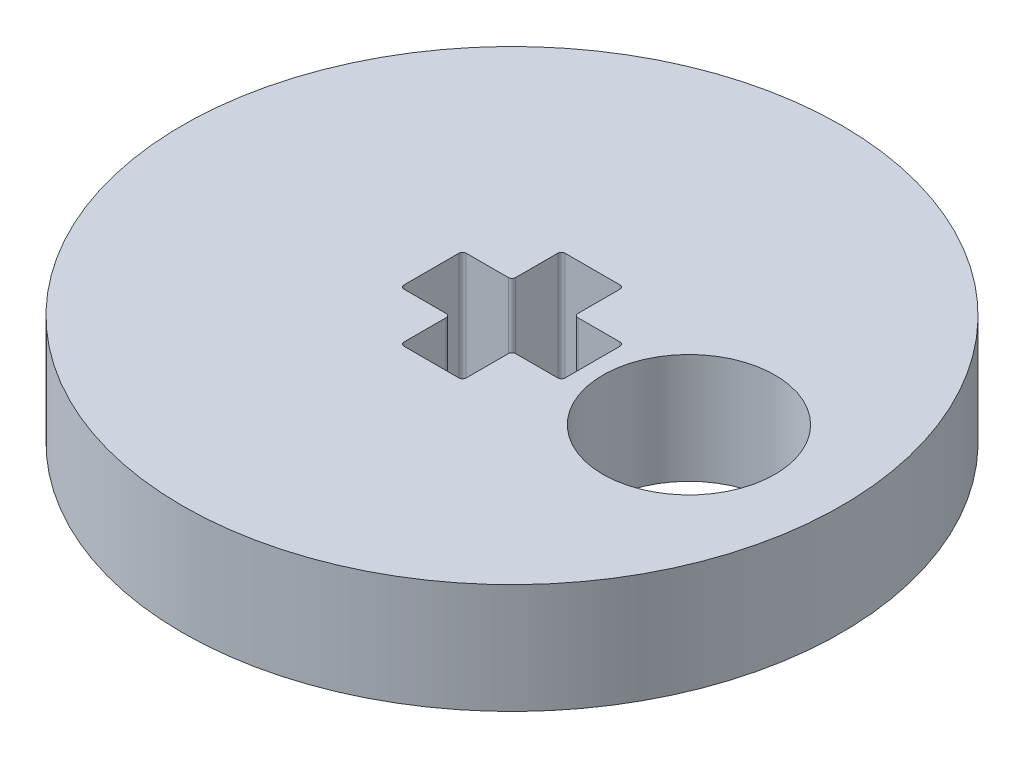
ISO-10303-21;
HEADER;
FILE_DESCRIPTION(('STEP AP214'),'2;1');
FILE_NAME('part.step','',(''),(''),'','','');
FILE_SCHEMA(('AUTOMOTIVE_DESIGN { 1 0 10303 214 1 1 1 1 }'));
ENDSEC;
DATA;
#1=APPLICATION_CONTEXT('core data for automotive mechanical design processes');
#2=APPLICATION_PROTOCOL_DEFINITION('international standard','automotive_design',2000,#1);
#3=PRODUCT_CONTEXT('',#1,'mechanical');
#4=PRODUCT('Part','Part','',(#3));
#5=PRODUCT_RELATED_PRODUCT_CATEGORY('part','',(#4));
#6=PRODUCT_DEFINITION_FORMATION('','',#4);
#7=PRODUCT_DEFINITION_CONTEXT('part definition',#1,'design');
#8=PRODUCT_DEFINITION('design','',#6,#7);
#9=PRODUCT_DEFINITION_SHAPE('','',#8);
#10=(LENGTH_UNIT() NAMED_UNIT(*) SI_UNIT(.MILLI.,.METRE.));
#11=(NAMED_UNIT(*) PLANE_ANGLE_UNIT() SI_UNIT($,.RADIAN.));
#12=(NAMED_UNIT(*) SI_UNIT($,.STERADIAN.) SOLID_ANGLE_UNIT());
#13=UNCERTAINTY_MEASURE_WITH_UNIT(LENGTH_MEASURE(1.E-05),#10,'distance_accuracy_value','');
#14=(GEOMETRIC_REPRESENTATION_CONTEXT(3) GLOBAL_UNCERTAINTY_ASSIGNED_CONTEXT((#13)) GLOBAL_UNIT_ASSIGNED_CONTEXT((#10,
#11,#12)) REPRESENTATION_CONTEXT('',''));
#15=CARTESIAN_POINT('',(0.,0.,0.));
#16=DIRECTION('',(0.,0.,1.));
#17=DIRECTION('',(1.,0.,0.));
#18=AXIS2_PLACEMENT_3D('',#15,#16,#17);
#19=CARTESIAN_POINT('',(0.,3.,0.));
#20=DIRECTION('',(0.,1.,0.));
#21=DIRECTION('',(0.,0.,1.));
#22=AXIS2_PLACEMENT_3D('',#19,#20,#21);
#23=PLANE('',#22);
#24=DIRECTION('',(1.,0.,0.));
#25=VECTOR('',#24,1.);
#26=CARTESIAN_POINT('',(0.850000000000001,3.,0.850000000000001));
#27=LINE('',#26,#25);
#28=CARTESIAN_POINT('',(0.950000000000001,3.,0.850000000000001));
#29=VERTEX_POINT('',#28);
#30=CARTESIAN_POINT('',(2.1,3.,0.850000000000001));
#31=VERTEX_POINT('',#30);
#32=EDGE_CURVE('E376',#29,#31,#27,.T.);
#33=ORIENTED_EDGE('',*,*,#32,.F.);
#34=CARTESIAN_POINT('',(0.950000000000001,3.,0.950000000000001));
#35=DIRECTION('',(0.,1.,0.));
#36=DIRECTION('',(0.,0.,1.));
#37=AXIS2_PLACEMENT_3D('',#34,#35,#36);
#38=CIRCLE('',#37,0.1);
#39=CARTESIAN_POINT('',(0.850000000000001,3.,0.950000000000001));
#40=VERTEX_POINT('',#39);
#41=EDGE_CURVE('E230',#29,#40,#38,.T.);
#42=ORIENTED_EDGE('',*,*,#41,.T.);
#43=DIRECTION('',(0.,0.,-1.));
#44=VECTOR('',#43,1.);
#45=CARTESIAN_POINT('',(0.850000000000001,3.,2.2));
#46=LINE('',#45,#44);
#47=CARTESIAN_POINT('',(0.850000000000001,3.,2.1));
#48=VERTEX_POINT('',#47);
#49=EDGE_CURVE('E373',#48,#40,#46,.T.);
#50=ORIENTED_EDGE('',*,*,#49,.F.);
#51=CARTESIAN_POINT('',(0.75,3.,2.1));
#52=DIRECTION('',(0.,1.,0.));
#53=DIRECTION('',(0.,0.,1.));
#54=AXIS2_PLACEMENT_3D('',#51,#52,#53);
#55=CIRCLE('',#54,0.1);
#56=CARTESIAN_POINT('',(0.75,3.,2.2));
#57=VERTEX_POINT('',#56);
#58=EDGE_CURVE('E308',#48,#57,#55,.F.);
#59=ORIENTED_EDGE('',*,*,#58,.T.);
#60=DIRECTION('',(1.,0.,0.));
#61=VECTOR('',#60,1.);
#62=CARTESIAN_POINT('',(-0.849999999999999,3.,2.2));
#63=LINE('',#62,#61);
#64=CARTESIAN_POINT('',(-0.749999999999999,3.,2.2));
#65=VERTEX_POINT('',#64);
#66=EDGE_CURVE('E370',#65,#57,#63,.T.);
#67=ORIENTED_EDGE('',*,*,#66,.F.);
#68=CARTESIAN_POINT('',(-0.749999999999999,3.,2.1));
#69=DIRECTION('',(0.,1.,0.));
#70=DIRECTION('',(0.,0.,1.));
#71=AXIS2_PLACEMENT_3D('',#68,#69,#70);
#72=CIRCLE('',#71,0.1);
#73=CARTESIAN_POINT('',(-0.849999999999999,3.,2.1));
#74=VERTEX_POINT('',#73);
#75=EDGE_CURVE('E312',#65,#74,#72,.F.);
#76=ORIENTED_EDGE('',*,*,#75,.T.);
#77=DIRECTION('',(0.,0.,1.));
#78=VECTOR('',#77,1.);
#79=CARTESIAN_POINT('',(-0.849999999999999,3.,0.850000000000001));
#80=LINE('',#79,#78);
#81=CARTESIAN_POINT('',(-0.849999999999999,3.,0.950000000000001));
#82=VERTEX_POINT('',#81);
#83=EDGE_CURVE('E367',#82,#74,#80,.T.);
#84=ORIENTED_EDGE('',*,*,#83,.F.);
#85=CARTESIAN_POINT('',(-0.949999999999999,3.,0.950000000000001));
#86=DIRECTION('',(0.,1.,0.));
#87=DIRECTION('',(0.,0.,1.));
#88=AXIS2_PLACEMENT_3D('',#85,#86,#87);
#89=CIRCLE('',#88,0.1);
#90=CARTESIAN_POINT('',(-0.95,3.,0.850000000000001));
#91=VERTEX_POINT('',#90);
#92=EDGE_CURVE('E57',#82,#91,#89,.T.);
#93=ORIENTED_EDGE('',*,*,#92,.T.);
#94=DIRECTION('',(1.,0.,0.));
#95=VECTOR('',#94,1.);
#96=CARTESIAN_POINT('',(-2.2,3.,0.850000000000001));
#97=LINE('',#96,#95);
#98=CARTESIAN_POINT('',(-2.1,3.,0.850000000000001));
#99=VERTEX_POINT('',#98);
#100=EDGE_CURVE('E357',#99,#91,#97,.T.);
#101=ORIENTED_EDGE('',*,*,#100,.F.);
#102=CARTESIAN_POINT('',(-2.1,3.,0.750000000000001));
#103=DIRECTION('',(0.,1.,0.));
#104=DIRECTION('',(0.,0.,1.));
#105=AXIS2_PLACEMENT_3D('',#102,#103,#104);
#106=CIRCLE('',#105,0.1);
#107=CARTESIAN_POINT('',(-2.2,3.,0.750000000000001));
#108=VERTEX_POINT('',#107);
#109=EDGE_CURVE('E316',#99,#108,#106,.F.);
#110=ORIENTED_EDGE('',*,*,#109,.T.);
#111=DIRECTION('',(0.,0.,1.));
#112=VECTOR('',#111,1.);
#113=CARTESIAN_POINT('',(-2.2,3.,-0.849999999999999));
#114=LINE('',#113,#112);
#115=CARTESIAN_POINT('',(-2.2,3.,-0.749999999999999));
#116=VERTEX_POINT('',#115);
#117=EDGE_CURVE('E351',#116,#108,#114,.T.);
#118=ORIENTED_EDGE('',*,*,#117,.F.);
#119=CARTESIAN_POINT('',(-2.1,3.,-0.749999999999999));
#120=DIRECTION('',(0.,1.,0.));
#121=DIRECTION('',(0.,0.,1.));
#122=AXIS2_PLACEMENT_3D('',#119,#120,#121);
#123=CIRCLE('',#122,0.1);
#124=CARTESIAN_POINT('',(-2.1,3.,-0.849999999999999));
#125=VERTEX_POINT('',#124);
#126=EDGE_CURVE('E11',#116,#125,#123,.F.);
#127=ORIENTED_EDGE('',*,*,#126,.T.);
#128=DIRECTION('',(-1.,0.,0.));
#129=VECTOR('',#128,1.);
#130=CARTESIAN_POINT('',(-0.849999999999999,3.,-0.849999999999999));
#131=LINE('',#130,#129);
#132=CARTESIAN_POINT('',(-0.949999999999999,3.,-0.849999999999999));
#133=VERTEX_POINT('',#132);
#134=EDGE_CURVE('E349',#133,#125,#131,.T.);
#135=ORIENTED_EDGE('',*,*,#134,.F.);
#136=CARTESIAN_POINT('',(-0.949999999999999,3.,-0.95));
#137=DIRECTION('',(0.,1.,0.));
#138=DIRECTION('',(0.,0.,1.));
#139=AXIS2_PLACEMENT_3D('',#136,#137,#138);
#140=CIRCLE('',#139,0.1);
#141=CARTESIAN_POINT('',(-0.849999999999999,3.,-0.95));
#142=VERTEX_POINT('',#141);
#143=EDGE_CURVE('E215',#133,#142,#140,.T.);
#144=ORIENTED_EDGE('',*,*,#143,.T.);
#145=DIRECTION('',(0.,0.,1.));
#146=VECTOR('',#145,1.);
#147=CARTESIAN_POINT('',(-0.849999999999999,3.,-2.2));
#148=LINE('',#147,#146);
#149=CARTESIAN_POINT('',(-0.849999999999999,3.,-2.1));
#150=VERTEX_POINT('',#149);
#151=EDGE_CURVE('E390',#150,#142,#148,.T.);
#152=ORIENTED_EDGE('',*,*,#151,.F.);
#153=CARTESIAN_POINT('',(-0.749999999999999,3.,-2.1));
#154=DIRECTION('',(0.,1.,0.));
#155=DIRECTION('',(0.,0.,1.));
#156=AXIS2_PLACEMENT_3D('',#153,#154,#155);
#157=CIRCLE('',#156,0.1);
#158=CARTESIAN_POINT('',(-0.749999999999999,3.,-2.2));
#159=VERTEX_POINT('',#158);
#160=EDGE_CURVE('E328',#150,#159,#157,.F.);
#161=ORIENTED_EDGE('',*,*,#160,.T.);
#162=DIRECTION('',(-1.,0.,0.));
#163=VECTOR('',#162,1.);
#164=CARTESIAN_POINT('',(0.850000000000001,3.,-2.2));
#165=LINE('',#164,#163);
#166=CARTESIAN_POINT('',(0.750000000000001,3.,-2.2));
#167=VERTEX_POINT('',#166);
#168=EDGE_CURVE('E387',#167,#159,#165,.T.);
#169=ORIENTED_EDGE('',*,*,#168,.F.);
#170=CARTESIAN_POINT('',(0.750000000000001,3.,-2.1));
#171=DIRECTION('',(0.,1.,0.));
#172=DIRECTION('',(0.,0.,1.));
#173=AXIS2_PLACEMENT_3D('',#170,#171,#172);
#174=CIRCLE('',#173,0.1);
#175=CARTESIAN_POINT('',(0.850000000000001,3.,-2.1));
#176=VERTEX_POINT('',#175);
#177=EDGE_CURVE('E324',#167,#176,#174,.F.);
#178=ORIENTED_EDGE('',*,*,#177,.T.);
#179=DIRECTION('',(0.,0.,-1.));
#180=VECTOR('',#179,1.);
#181=CARTESIAN_POINT('',(0.850000000000001,3.,-0.85));
#182=LINE('',#181,#180);
#183=CARTESIAN_POINT('',(0.850000000000001,3.,-0.95));
#184=VERTEX_POINT('',#183);
#185=EDGE_CURVE('E384',#184,#176,#182,.T.);
#186=ORIENTED_EDGE('',*,*,#185,.F.);
#187=CARTESIAN_POINT('',(0.950000000000001,3.,-0.95));
#188=DIRECTION('',(0.,1.,0.));
#189=DIRECTION('',(0.,0.,1.));
#190=AXIS2_PLACEMENT_3D('',#187,#188,#189);
#191=CIRCLE('',#190,0.1);
#192=CARTESIAN_POINT('',(0.950000000000001,3.,-0.85));
#193=VERTEX_POINT('',#192);
#194=EDGE_CURVE('E254',#184,#193,#191,.T.);
#195=ORIENTED_EDGE('',*,*,#194,.T.);
#196=DIRECTION('',(-1.,0.,0.));
#197=VECTOR('',#196,1.);
#198=CARTESIAN_POINT('',(2.2,3.,-0.85));
#199=LINE('',#198,#197);
#200=CARTESIAN_POINT('',(2.1,3.,-0.85));
#201=VERTEX_POINT('',#200);
#202=EDGE_CURVE('E381',#201,#193,#199,.T.);
#203=ORIENTED_EDGE('',*,*,#202,.F.);
#204=CARTESIAN_POINT('',(2.1,3.,-0.75));
#205=DIRECTION('',(0.,1.,0.));
#206=DIRECTION('',(0.,0.,1.));
#207=AXIS2_PLACEMENT_3D('',#204,#205,#206);
#208=CIRCLE('',#207,0.1);
#209=CARTESIAN_POINT('',(2.2,3.,-0.75));
#210=VERTEX_POINT('',#209);
#211=EDGE_CURVE('E320',#201,#210,#208,.F.);
#212=ORIENTED_EDGE('',*,*,#211,.T.);
#213=DIRECTION('',(0.,0.,-1.));
#214=VECTOR('',#213,1.);
#215=CARTESIAN_POINT('',(2.2,3.,0.850000000000001));
#216=LINE('',#215,#214);
#217=CARTESIAN_POINT('',(2.2,3.,0.750000000000001));
#218=VERTEX_POINT('',#217);
#219=EDGE_CURVE('E378',#218,#210,#216,.T.);
#220=ORIENTED_EDGE('',*,*,#219,.F.);
#221=CARTESIAN_POINT('',(2.1,3.,0.750000000000001));
#222=DIRECTION('',(0.,1.,0.));
#223=DIRECTION('',(0.,0.,1.));
#224=AXIS2_PLACEMENT_3D('',#221,#222,#223);
#225=CIRCLE('',#224,0.1);
#226=EDGE_CURVE('E304',#218,#31,#225,.F.);
#227=ORIENTED_EDGE('',*,*,#226,.T.);
#228=EDGE_LOOP('',(#33,#42,#50,#59,#67,#76,#84,#93,#101,#110,#118,#127,#135,#144,#152,#161,#169,
#178,#186,#195,#203,#212,#220,#227));
#229=FACE_BOUND('',#228,.T.);
#230=CARTESIAN_POINT('',(0.,3.,0.));
#231=DIRECTION('',(0.,1.,0.));
#232=DIRECTION('',(0.,0.,1.));
#233=AXIS2_PLACEMENT_3D('',#230,#231,#232);
#234=CIRCLE('',#233,9.);
#235=CARTESIAN_POINT('',(0.,3.,9.));
#236=VERTEX_POINT('',#235);
#237=EDGE_CURVE('E231',#236,#236,#234,.T.);
#238=ORIENTED_EDGE('',*,*,#237,.T.);
#239=EDGE_LOOP('',(#238));
#240=FACE_BOUND('',#239,.T.);
#241=CARTESIAN_POINT('',(4.99728198946741,3.,0.16484149278824));
#242=DIRECTION('',(0.,1.,0.));
#243=DIRECTION('',(0.,0.,1.));
#244=AXIS2_PLACEMENT_3D('',#241,#242,#243);
#245=CIRCLE('',#244,2.35);
#246=CARTESIAN_POINT('',(4.99728198946741,3.,2.51484149278824));
#247=VERTEX_POINT('',#246);
#248=EDGE_CURVE('E393',#247,#247,#245,.T.);
#249=ORIENTED_EDGE('',*,*,#248,.F.);
#250=EDGE_LOOP('',(#249));
#251=FACE_BOUND('',#250,.T.);
#252=ADVANCED_FACE('F42',(#229,#240,#251),#23,.T.);
#253=CARTESIAN_POINT('',(0.,0.,0.));
#254=DIRECTION('',(0.,1.,0.));
#255=DIRECTION('',(0.,0.,1.));
#256=AXIS2_PLACEMENT_3D('',#253,#254,#255);
#257=PLANE('',#256);
#258=CARTESIAN_POINT('',(0.,0.,0.));
#259=DIRECTION('',(0.,1.,0.));
#260=DIRECTION('',(0.,0.,1.));
#261=AXIS2_PLACEMENT_3D('',#258,#259,#260);
#262=CIRCLE('',#261,9.);
#263=CARTESIAN_POINT('',(0.,0.,9.));
#264=VERTEX_POINT('',#263);
#265=EDGE_CURVE('E236',#264,#264,#262,.T.);
#266=ORIENTED_EDGE('',*,*,#265,.F.);
#267=EDGE_LOOP('',(#266));
#268=FACE_BOUND('',#267,.T.);
#269=DIRECTION('',(0.,0.,-1.));
#270=VECTOR('',#269,1.);
#271=CARTESIAN_POINT('',(0.850000000000001,0.,2.2));
#272=LINE('',#271,#270);
#273=CARTESIAN_POINT('',(0.850000000000001,0.,2.1));
#274=VERTEX_POINT('',#273);
#275=CARTESIAN_POINT('',(0.850000000000001,0.,0.950000000000001));
#276=VERTEX_POINT('',#275);
#277=EDGE_CURVE('E210',#274,#276,#272,.T.);
#278=ORIENTED_EDGE('',*,*,#277,.T.);
#279=CARTESIAN_POINT('',(0.950000000000001,0.,0.950000000000001));
#280=DIRECTION('',(0.,1.,0.));
#281=DIRECTION('',(0.,0.,1.));
#282=AXIS2_PLACEMENT_3D('',#279,#280,#281);
#283=CIRCLE('',#282,0.1);
#284=CARTESIAN_POINT('',(0.950000000000001,0.,0.850000000000001));
#285=VERTEX_POINT('',#284);
#286=EDGE_CURVE('E204',#276,#285,#283,.F.);
#287=ORIENTED_EDGE('',*,*,#286,.T.);
#288=DIRECTION('',(1.,0.,0.));
#289=VECTOR('',#288,1.);
#290=CARTESIAN_POINT('',(0.850000000000001,0.,0.850000000000001));
#291=LINE('',#290,#289);
#292=CARTESIAN_POINT('',(2.1,0.,0.850000000000001));
#293=VERTEX_POINT('',#292);
#294=EDGE_CURVE('E208',#285,#293,#291,.T.);
#295=ORIENTED_EDGE('',*,*,#294,.T.);
#296=CARTESIAN_POINT('',(2.1,0.,0.750000000000001));
#297=DIRECTION('',(0.,1.,0.));
#298=DIRECTION('',(0.,0.,1.));
#299=AXIS2_PLACEMENT_3D('',#296,#297,#298);
#300=CIRCLE('',#299,0.1);
#301=CARTESIAN_POINT('',(2.2,0.,0.750000000000001));
#302=VERTEX_POINT('',#301);
#303=EDGE_CURVE('E302',#293,#302,#300,.T.);
#304=ORIENTED_EDGE('',*,*,#303,.T.);
#305=DIRECTION('',(0.,0.,-1.));
#306=VECTOR('',#305,1.);
#307=CARTESIAN_POINT('',(2.2,0.,0.850000000000001));
#308=LINE('',#307,#306);
#309=CARTESIAN_POINT('',(2.2,0.,-0.75));
#310=VERTEX_POINT('',#309);
#311=EDGE_CURVE('E226',#302,#310,#308,.T.);
#312=ORIENTED_EDGE('',*,*,#311,.T.);
#313=CARTESIAN_POINT('',(2.1,0.,-0.75));
#314=DIRECTION('',(0.,1.,0.));
#315=DIRECTION('',(0.,0.,1.));
#316=AXIS2_PLACEMENT_3D('',#313,#314,#315);
#317=CIRCLE('',#316,0.1);
#318=CARTESIAN_POINT('',(2.1,0.,-0.85));
#319=VERTEX_POINT('',#318);
#320=EDGE_CURVE('E318',#310,#319,#317,.T.);
#321=ORIENTED_EDGE('',*,*,#320,.T.);
#322=DIRECTION('',(-1.,0.,0.));
#323=VECTOR('',#322,1.);
#324=CARTESIAN_POINT('',(2.2,0.,-0.85));
#325=LINE('',#324,#323);
#326=CARTESIAN_POINT('',(0.950000000000001,0.,-0.85));
#327=VERTEX_POINT('',#326);
#328=EDGE_CURVE('E406',#319,#327,#325,.T.);
#329=ORIENTED_EDGE('',*,*,#328,.T.);
#330=CARTESIAN_POINT('',(0.950000000000001,0.,-0.95));
#331=DIRECTION('',(0.,1.,0.));
#332=DIRECTION('',(0.,0.,1.));
#333=AXIS2_PLACEMENT_3D('',#330,#331,#332);
#334=CIRCLE('',#333,0.1);
#335=CARTESIAN_POINT('',(0.850000000000001,0.,-0.95));
#336=VERTEX_POINT('',#335);
#337=EDGE_CURVE('E250',#327,#336,#334,.F.);
#338=ORIENTED_EDGE('',*,*,#337,.T.);
#339=DIRECTION('',(0.,0.,-1.));
#340=VECTOR('',#339,1.);
#341=CARTESIAN_POINT('',(0.850000000000001,0.,-0.85));
#342=LINE('',#341,#340);
#343=CARTESIAN_POINT('',(0.850000000000001,0.,-2.1));
#344=VERTEX_POINT('',#343);
#345=EDGE_CURVE('E409',#336,#344,#342,.T.);
#346=ORIENTED_EDGE('',*,*,#345,.T.);
#347=CARTESIAN_POINT('',(0.750000000000001,0.,-2.1));
#348=DIRECTION('',(0.,1.,0.));
#349=DIRECTION('',(0.,0.,1.));
#350=AXIS2_PLACEMENT_3D('',#347,#348,#349);
#351=CIRCLE('',#350,0.1);
#352=CARTESIAN_POINT('',(0.750000000000001,0.,-2.2));
#353=VERTEX_POINT('',#352);
#354=EDGE_CURVE('E322',#344,#353,#351,.T.);
#355=ORIENTED_EDGE('',*,*,#354,.T.);
#356=DIRECTION('',(-1.,0.,0.));
#357=VECTOR('',#356,1.);
#358=CARTESIAN_POINT('',(0.850000000000001,0.,-2.2));
#359=LINE('',#358,#357);
#360=CARTESIAN_POINT('',(-0.749999999999999,0.,-2.2));
#361=VERTEX_POINT('',#360);
#362=EDGE_CURVE('E360',#353,#361,#359,.T.);
#363=ORIENTED_EDGE('',*,*,#362,.T.);
#364=CARTESIAN_POINT('',(-0.749999999999999,0.,-2.1));
#365=DIRECTION('',(0.,1.,0.));
#366=DIRECTION('',(0.,0.,1.));
#367=AXIS2_PLACEMENT_3D('',#364,#365,#366);
#368=CIRCLE('',#367,0.1);
#369=CARTESIAN_POINT('',(-0.849999999999999,0.,-2.1));
#370=VERTEX_POINT('',#369);
#371=EDGE_CURVE('E326',#361,#370,#368,.T.);
#372=ORIENTED_EDGE('',*,*,#371,.T.);
#373=DIRECTION('',(0.,0.,1.));
#374=VECTOR('',#373,1.);
#375=CARTESIAN_POINT('',(-0.849999999999999,0.,-2.2));
#376=LINE('',#375,#374);
#377=CARTESIAN_POINT('',(-0.849999999999999,0.,-0.95));
#378=VERTEX_POINT('',#377);
#379=EDGE_CURVE('E355',#370,#378,#376,.T.);
#380=ORIENTED_EDGE('',*,*,#379,.T.);
#381=CARTESIAN_POINT('',(-0.949999999999999,0.,-0.95));
#382=DIRECTION('',(0.,1.,0.));
#383=DIRECTION('',(0.,0.,1.));
#384=AXIS2_PLACEMENT_3D('',#381,#382,#383);
#385=CIRCLE('',#384,0.1);
#386=CARTESIAN_POINT('',(-0.949999999999999,0.,-0.849999999999999));
#387=VERTEX_POINT('',#386);
#388=EDGE_CURVE('E248',#378,#387,#385,.F.);
#389=ORIENTED_EDGE('',*,*,#388,.T.);
#390=DIRECTION('',(-1.,0.,0.));
#391=VECTOR('',#390,1.);
#392=CARTESIAN_POINT('',(-0.849999999999999,0.,-0.849999999999999));
#393=LINE('',#392,#391);
#394=CARTESIAN_POINT('',(-2.1,0.,-0.849999999999999));
#395=VERTEX_POINT('',#394);
#396=EDGE_CURVE('E334',#387,#395,#393,.T.);
#397=ORIENTED_EDGE('',*,*,#396,.T.);
#398=CARTESIAN_POINT('',(-2.1,0.,-0.749999999999999));
#399=DIRECTION('',(0.,1.,0.));
#400=DIRECTION('',(0.,0.,1.));
#401=AXIS2_PLACEMENT_3D('',#398,#399,#400);
#402=CIRCLE('',#401,0.1);
#403=CARTESIAN_POINT('',(-2.2,0.,-0.749999999999999));
#404=VERTEX_POINT('',#403);
#405=EDGE_CURVE('E50',#395,#404,#402,.T.);
#406=ORIENTED_EDGE('',*,*,#405,.T.);
#407=DIRECTION('',(0.,0.,1.));
#408=VECTOR('',#407,1.);
#409=CARTESIAN_POINT('',(-2.2,0.,-0.849999999999999));
#410=LINE('',#409,#408);
#411=CARTESIAN_POINT('',(-2.2,0.,0.750000000000001));
#412=VERTEX_POINT('',#411);
#413=EDGE_CURVE('E332',#404,#412,#410,.T.);
#414=ORIENTED_EDGE('',*,*,#413,.T.);
#415=CARTESIAN_POINT('',(-2.1,0.,0.750000000000001));
#416=DIRECTION('',(0.,1.,0.));
#417=DIRECTION('',(0.,0.,1.));
#418=AXIS2_PLACEMENT_3D('',#415,#416,#417);
#419=CIRCLE('',#418,0.1);
#420=CARTESIAN_POINT('',(-2.1,0.,0.850000000000001));
#421=VERTEX_POINT('',#420);
#422=EDGE_CURVE('E314',#412,#421,#419,.T.);
#423=ORIENTED_EDGE('',*,*,#422,.T.);
#424=DIRECTION('',(1.,0.,0.));
#425=VECTOR('',#424,1.);
#426=CARTESIAN_POINT('',(-2.2,0.,0.850000000000001));
#427=LINE('',#426,#425);
#428=CARTESIAN_POINT('',(-0.95,0.,0.850000000000001));
#429=VERTEX_POINT('',#428);
#430=EDGE_CURVE('E343',#421,#429,#427,.T.);
#431=ORIENTED_EDGE('',*,*,#430,.T.);
#432=CARTESIAN_POINT('',(-0.949999999999999,0.,0.950000000000001));
#433=DIRECTION('',(0.,1.,0.));
#434=DIRECTION('',(0.,0.,1.));
#435=AXIS2_PLACEMENT_3D('',#432,#433,#434);
#436=CIRCLE('',#435,0.1);
#437=CARTESIAN_POINT('',(-0.849999999999999,0.,0.950000000000001));
#438=VERTEX_POINT('',#437);
#439=EDGE_CURVE('E216',#429,#438,#436,.F.);
#440=ORIENTED_EDGE('',*,*,#439,.T.);
#441=DIRECTION('',(0.,0.,1.));
#442=VECTOR('',#441,1.);
#443=CARTESIAN_POINT('',(-0.849999999999999,0.,0.850000000000001));
#444=LINE('',#443,#442);
#445=CARTESIAN_POINT('',(-0.849999999999999,0.,2.1));
#446=VERTEX_POINT('',#445);
#447=EDGE_CURVE('E397',#438,#446,#444,.T.);
#448=ORIENTED_EDGE('',*,*,#447,.T.);
#449=CARTESIAN_POINT('',(-0.749999999999999,0.,2.1));
#450=DIRECTION('',(0.,1.,0.));
#451=DIRECTION('',(0.,0.,1.));
#452=AXIS2_PLACEMENT_3D('',#449,#450,#451);
#453=CIRCLE('',#452,0.1);
#454=CARTESIAN_POINT('',(-0.749999999999999,0.,2.2));
#455=VERTEX_POINT('',#454);
#456=EDGE_CURVE('E310',#446,#455,#453,.T.);
#457=ORIENTED_EDGE('',*,*,#456,.T.);
#458=DIRECTION('',(1.,0.,0.));
#459=VECTOR('',#458,1.);
#460=CARTESIAN_POINT('',(-0.849999999999999,0.,2.2));
#461=LINE('',#460,#459);
#462=CARTESIAN_POINT('',(0.75,0.,2.2));
#463=VERTEX_POINT('',#462);
#464=EDGE_CURVE('E400',#455,#463,#461,.T.);
#465=ORIENTED_EDGE('',*,*,#464,.T.);
#466=CARTESIAN_POINT('',(0.75,0.,2.1));
#467=DIRECTION('',(0.,1.,0.));
#468=DIRECTION('',(0.,0.,1.));
#469=AXIS2_PLACEMENT_3D('',#466,#467,#468);
#470=CIRCLE('',#469,0.1);
#471=EDGE_CURVE('E306',#463,#274,#470,.T.);
#472=ORIENTED_EDGE('',*,*,#471,.T.);
#473=EDGE_LOOP('',(#278,#287,#295,#304,#312,#321,#329,#338,#346,#355,#363,#372,#380,#389,#397,
#406,#414,#423,#431,#440,#448,#457,#465,#472));
#474=FACE_BOUND('',#473,.T.);
#475=CARTESIAN_POINT('',(4.99728198946741,0.,0.16484149278824));
#476=DIRECTION('',(0.,1.,0.));
#477=DIRECTION('',(0.,0.,1.));
#478=AXIS2_PLACEMENT_3D('',#475,#476,#477);
#479=CIRCLE('',#478,2.35);
#480=CARTESIAN_POINT('',(4.99728198946741,0.,2.51484149278824));
#481=VERTEX_POINT('',#480);
#482=EDGE_CURVE('E363',#481,#481,#479,.T.);
#483=ORIENTED_EDGE('',*,*,#482,.T.);
#484=EDGE_LOOP('',(#483));
#485=FACE_BOUND('',#484,.T.);
#486=ADVANCED_FACE('F206',(#268,#474,#485),#257,.F.);
#487=CARTESIAN_POINT('',(0.,3.,0.));
#488=DIRECTION('',(0.,-1.,0.));
#489=DIRECTION('',(0.,0.,-1.));
#490=AXIS2_PLACEMENT_3D('',#487,#488,#489);
#491=CYLINDRICAL_SURFACE('',#490,9.);
#492=ORIENTED_EDGE('',*,*,#237,.F.);
#493=EDGE_LOOP('',(#492));
#494=FACE_BOUND('',#493,.T.);
#495=ORIENTED_EDGE('',*,*,#265,.T.);
#496=EDGE_LOOP('',(#495));
#497=FACE_BOUND('',#496,.T.);
#498=ADVANCED_FACE('F492',(#494,#497),#491,.T.);
#499=CARTESIAN_POINT('',(-0.849999999999999,3.,-0.849999999999999));
#500=DIRECTION('',(0.,0.,1.));
#501=DIRECTION('',(1.,0.,0.));
#502=AXIS2_PLACEMENT_3D('',#499,#500,#501);
#503=PLANE('',#502);
#504=ORIENTED_EDGE('',*,*,#396,.F.);
#505=DIRECTION('',(0.,-1.,0.));
#506=VECTOR('',#505,1.);
#507=CARTESIAN_POINT('',(-0.949999999999999,3.,-0.849999999999999));
#508=LINE('',#507,#506);
#509=EDGE_CURVE('E300',#387,#133,#508,.F.);
#510=ORIENTED_EDGE('',*,*,#509,.T.);
#511=ORIENTED_EDGE('',*,*,#134,.T.);
#512=DIRECTION('',(0.,-1.,0.));
#513=VECTOR('',#512,1.);
#514=CARTESIAN_POINT('',(-2.1,0.,-0.849999999999999));
#515=LINE('',#514,#513);
#516=EDGE_CURVE('E297',#125,#395,#515,.T.);
#517=ORIENTED_EDGE('',*,*,#516,.T.);
#518=EDGE_LOOP('',(#504,#510,#511,#517));
#519=FACE_BOUND('',#518,.T.);
#520=ADVANCED_FACE('F353',(#519),#503,.T.);
#521=CARTESIAN_POINT('',(-2.2,3.,-0.849999999999999));
#522=DIRECTION('',(1.,0.,0.));
#523=DIRECTION('',(0.,0.,-1.));
#524=AXIS2_PLACEMENT_3D('',#521,#522,#523);
#525=PLANE('',#524);
#526=ORIENTED_EDGE('',*,*,#117,.T.);
#527=DIRECTION('',(0.,-1.,0.));
#528=VECTOR('',#527,1.);
#529=CARTESIAN_POINT('',(-2.2,0.,0.750000000000001));
#530=LINE('',#529,#528);
#531=EDGE_CURVE('E274',#108,#412,#530,.T.);
#532=ORIENTED_EDGE('',*,*,#531,.T.);
#533=ORIENTED_EDGE('',*,*,#413,.F.);
#534=DIRECTION('',(0.,-1.,0.));
#535=VECTOR('',#534,1.);
#536=CARTESIAN_POINT('',(-2.2,3.,-0.749999999999999));
#537=LINE('',#536,#535);
#538=EDGE_CURVE('E272',#404,#116,#537,.F.);
#539=ORIENTED_EDGE('',*,*,#538,.T.);
#540=EDGE_LOOP('',(#526,#532,#533,#539));
#541=FACE_BOUND('',#540,.T.);
#542=ADVANCED_FACE('F340',(#541),#525,.T.);
#543=CARTESIAN_POINT('',(-2.2,3.,0.850000000000001));
#544=DIRECTION('',(0.,0.,-1.));
#545=DIRECTION('',(-1.,0.,0.));
#546=AXIS2_PLACEMENT_3D('',#543,#544,#545);
#547=PLANE('',#546);
#548=ORIENTED_EDGE('',*,*,#100,.T.);
#549=DIRECTION('',(0.,-1.,0.));
#550=VECTOR('',#549,1.);
#551=CARTESIAN_POINT('',(-0.949999999999999,3.,0.850000000000001));
#552=LINE('',#551,#550);
#553=EDGE_CURVE('E269',#91,#429,#552,.T.);
#554=ORIENTED_EDGE('',*,*,#553,.T.);
#555=ORIENTED_EDGE('',*,*,#430,.F.);
#556=DIRECTION('',(0.,-1.,0.));
#557=VECTOR('',#556,1.);
#558=CARTESIAN_POINT('',(-2.1,3.,0.850000000000001));
#559=LINE('',#558,#557);
#560=EDGE_CURVE('E64',#421,#99,#559,.F.);
#561=ORIENTED_EDGE('',*,*,#560,.T.);
#562=EDGE_LOOP('',(#548,#554,#555,#561));
#563=FACE_BOUND('',#562,.T.);
#564=ADVANCED_FACE('F474',(#563),#547,.T.);
#565=CARTESIAN_POINT('',(-0.849999999999999,3.,0.850000000000001));
#566=DIRECTION('',(1.,0.,0.));
#567=DIRECTION('',(0.,0.,-1.));
#568=AXIS2_PLACEMENT_3D('',#565,#566,#567);
#569=PLANE('',#568);
#570=ORIENTED_EDGE('',*,*,#83,.T.);
#571=DIRECTION('',(0.,-1.,0.));
#572=VECTOR('',#571,1.);
#573=CARTESIAN_POINT('',(-0.849999999999999,0.,2.1));
#574=LINE('',#573,#572);
#575=EDGE_CURVE('E265',#74,#446,#574,.T.);
#576=ORIENTED_EDGE('',*,*,#575,.T.);
#577=ORIENTED_EDGE('',*,*,#447,.F.);
#578=DIRECTION('',(0.,-1.,0.));
#579=VECTOR('',#578,1.);
#580=CARTESIAN_POINT('',(-0.849999999999999,3.,0.950000000000001));
#581=LINE('',#580,#579);
#582=EDGE_CURVE('E263',#438,#82,#581,.F.);
#583=ORIENTED_EDGE('',*,*,#582,.T.);
#584=EDGE_LOOP('',(#570,#576,#577,#583));
#585=FACE_BOUND('',#584,.T.);
#586=ADVANCED_FACE('F468',(#585),#569,.T.);
#587=CARTESIAN_POINT('',(-0.849999999999999,3.,2.2));
#588=DIRECTION('',(0.,0.,-1.));
#589=DIRECTION('',(-1.,0.,0.));
#590=AXIS2_PLACEMENT_3D('',#587,#588,#589);
#591=PLANE('',#590);
#592=ORIENTED_EDGE('',*,*,#66,.T.);
#593=DIRECTION('',(0.,-1.,0.));
#594=VECTOR('',#593,1.);
#595=CARTESIAN_POINT('',(0.75,0.,2.2));
#596=LINE('',#595,#594);
#597=EDGE_CURVE('E260',#57,#463,#596,.T.);
#598=ORIENTED_EDGE('',*,*,#597,.T.);
#599=ORIENTED_EDGE('',*,*,#464,.F.);
#600=DIRECTION('',(0.,-1.,0.));
#601=VECTOR('',#600,1.);
#602=CARTESIAN_POINT('',(-0.749999999999999,3.,2.2));
#603=LINE('',#602,#601);
#604=EDGE_CURVE('E258',#455,#65,#603,.F.);
#605=ORIENTED_EDGE('',*,*,#604,.T.);
#606=EDGE_LOOP('',(#592,#598,#599,#605));
#607=FACE_BOUND('',#606,.T.);
#608=ADVANCED_FACE('F461',(#607),#591,.T.);
#609=CARTESIAN_POINT('',(0.850000000000001,3.,2.2));
#610=DIRECTION('',(-1.,0.,0.));
#611=DIRECTION('',(0.,0.,1.));
#612=AXIS2_PLACEMENT_3D('',#609,#610,#611);
#613=PLANE('',#612);
#614=ORIENTED_EDGE('',*,*,#49,.T.);
#615=DIRECTION('',(0.,-1.,0.));
#616=VECTOR('',#615,1.);
#617=CARTESIAN_POINT('',(0.850000000000001,3.,0.950000000000001));
#618=LINE('',#617,#616);
#619=EDGE_CURVE('E246',#40,#276,#618,.T.);
#620=ORIENTED_EDGE('',*,*,#619,.T.);
#621=ORIENTED_EDGE('',*,*,#277,.F.);
#622=DIRECTION('',(0.,-1.,0.));
#623=VECTOR('',#622,1.);
#624=CARTESIAN_POINT('',(0.850000000000001,3.,2.1));
#625=LINE('',#624,#623);
#626=EDGE_CURVE('E244',#274,#48,#625,.F.);
#627=ORIENTED_EDGE('',*,*,#626,.T.);
#628=EDGE_LOOP('',(#614,#620,#621,#627));
#629=FACE_BOUND('',#628,.T.);
#630=ADVANCED_FACE('F453',(#629),#613,.T.);
#631=CARTESIAN_POINT('',(0.850000000000001,3.,0.850000000000001));
#632=DIRECTION('',(0.,0.,-1.));
#633=DIRECTION('',(-1.,0.,0.));
#634=AXIS2_PLACEMENT_3D('',#631,#632,#633);
#635=PLANE('',#634);
#636=ORIENTED_EDGE('',*,*,#32,.T.);
#637=DIRECTION('',(0.,-1.,0.));
#638=VECTOR('',#637,1.);
#639=CARTESIAN_POINT('',(2.1,0.,0.850000000000001));
#640=LINE('',#639,#638);
#641=EDGE_CURVE('E225',#31,#293,#640,.T.);
#642=ORIENTED_EDGE('',*,*,#641,.T.);
#643=ORIENTED_EDGE('',*,*,#294,.F.);
#644=DIRECTION('',(0.,-1.,0.));
#645=VECTOR('',#644,1.);
#646=CARTESIAN_POINT('',(0.950000000000001,3.,0.850000000000001));
#647=LINE('',#646,#645);
#648=EDGE_CURVE('E222',#285,#29,#647,.F.);
#649=ORIENTED_EDGE('',*,*,#648,.T.);
#650=EDGE_LOOP('',(#636,#642,#643,#649));
#651=FACE_BOUND('',#650,.T.);
#652=ADVANCED_FACE('F221',(#651),#635,.T.);
#653=CARTESIAN_POINT('',(2.2,3.,0.850000000000001));
#654=DIRECTION('',(-1.,0.,0.));
#655=DIRECTION('',(0.,0.,1.));
#656=AXIS2_PLACEMENT_3D('',#653,#654,#655);
#657=PLANE('',#656);
#658=ORIENTED_EDGE('',*,*,#311,.F.);
#659=DIRECTION('',(0.,-1.,0.));
#660=VECTOR('',#659,1.);
#661=CARTESIAN_POINT('',(2.2,3.,0.750000000000001));
#662=LINE('',#661,#660);
#663=EDGE_CURVE('E242',#302,#218,#662,.F.);
#664=ORIENTED_EDGE('',*,*,#663,.T.);
#665=ORIENTED_EDGE('',*,*,#219,.T.);
#666=DIRECTION('',(0.,-1.,0.));
#667=VECTOR('',#666,1.);
#668=CARTESIAN_POINT('',(2.2,0.,-0.75));
#669=LINE('',#668,#667);
#670=EDGE_CURVE('E233',#210,#310,#669,.T.);
#671=ORIENTED_EDGE('',*,*,#670,.T.);
#672=EDGE_LOOP('',(#658,#664,#665,#671));
#673=FACE_BOUND('',#672,.T.);
#674=ADVANCED_FACE('F446',(#673),#657,.T.);
#675=CARTESIAN_POINT('',(2.2,3.,-0.85));
#676=DIRECTION('',(0.,0.,1.));
#677=DIRECTION('',(1.,0.,0.));
#678=AXIS2_PLACEMENT_3D('',#675,#676,#677);
#679=PLANE('',#678);
#680=ORIENTED_EDGE('',*,*,#328,.F.);
#681=DIRECTION('',(0.,-1.,0.));
#682=VECTOR('',#681,1.);
#683=CARTESIAN_POINT('',(2.1,3.,-0.85));
#684=LINE('',#683,#682);
#685=EDGE_CURVE('E280',#319,#201,#684,.F.);
#686=ORIENTED_EDGE('',*,*,#685,.T.);
#687=ORIENTED_EDGE('',*,*,#202,.T.);
#688=DIRECTION('',(0.,-1.,0.));
#689=VECTOR('',#688,1.);
#690=CARTESIAN_POINT('',(0.950000000000001,3.,-0.85));
#691=LINE('',#690,#689);
#692=EDGE_CURVE('E277',#193,#327,#691,.T.);
#693=ORIENTED_EDGE('',*,*,#692,.T.);
#694=EDGE_LOOP('',(#680,#686,#687,#693));
#695=FACE_BOUND('',#694,.T.);
#696=ADVANCED_FACE('F437',(#695),#679,.T.);
#697=CARTESIAN_POINT('',(0.850000000000001,3.,-0.85));
#698=DIRECTION('',(-1.,0.,0.));
#699=DIRECTION('',(0.,0.,1.));
#700=AXIS2_PLACEMENT_3D('',#697,#698,#699);
#701=PLANE('',#700);
#702=ORIENTED_EDGE('',*,*,#345,.F.);
#703=DIRECTION('',(0.,-1.,0.));
#704=VECTOR('',#703,1.);
#705=CARTESIAN_POINT('',(0.850000000000001,3.,-0.95));
#706=LINE('',#705,#704);
#707=EDGE_CURVE('E285',#336,#184,#706,.F.);
#708=ORIENTED_EDGE('',*,*,#707,.T.);
#709=ORIENTED_EDGE('',*,*,#185,.T.);
#710=DIRECTION('',(0.,-1.,0.));
#711=VECTOR('',#710,1.);
#712=CARTESIAN_POINT('',(0.850000000000001,0.,-2.1));
#713=LINE('',#712,#711);
#714=EDGE_CURVE('E282',#176,#344,#713,.T.);
#715=ORIENTED_EDGE('',*,*,#714,.T.);
#716=EDGE_LOOP('',(#702,#708,#709,#715));
#717=FACE_BOUND('',#716,.T.);
#718=ADVANCED_FACE('F428',(#717),#701,.T.);
#719=CARTESIAN_POINT('',(0.850000000000001,3.,-2.2));
#720=DIRECTION('',(0.,0.,1.));
#721=DIRECTION('',(1.,0.,0.));
#722=AXIS2_PLACEMENT_3D('',#719,#720,#721);
#723=PLANE('',#722);
#724=ORIENTED_EDGE('',*,*,#362,.F.);
#725=DIRECTION('',(0.,-1.,0.));
#726=VECTOR('',#725,1.);
#727=CARTESIAN_POINT('',(0.750000000000001,3.,-2.2));
#728=LINE('',#727,#726);
#729=EDGE_CURVE('E290',#353,#167,#728,.F.);
#730=ORIENTED_EDGE('',*,*,#729,.T.);
#731=ORIENTED_EDGE('',*,*,#168,.T.);
#732=DIRECTION('',(0.,-1.,0.));
#733=VECTOR('',#732,1.);
#734=CARTESIAN_POINT('',(-0.749999999999999,0.,-2.2));
#735=LINE('',#734,#733);
#736=EDGE_CURVE('E287',#159,#361,#735,.T.);
#737=ORIENTED_EDGE('',*,*,#736,.T.);
#738=EDGE_LOOP('',(#724,#730,#731,#737));
#739=FACE_BOUND('',#738,.T.);
#740=ADVANCED_FACE('F417',(#739),#723,.T.);
#741=CARTESIAN_POINT('',(-0.849999999999999,3.,-2.2));
#742=DIRECTION('',(1.,0.,0.));
#743=DIRECTION('',(0.,0.,-1.));
#744=AXIS2_PLACEMENT_3D('',#741,#742,#743);
#745=PLANE('',#744);
#746=ORIENTED_EDGE('',*,*,#379,.F.);
#747=DIRECTION('',(0.,-1.,0.));
#748=VECTOR('',#747,1.);
#749=CARTESIAN_POINT('',(-0.849999999999999,3.,-2.1));
#750=LINE('',#749,#748);
#751=EDGE_CURVE('E295',#370,#150,#750,.F.);
#752=ORIENTED_EDGE('',*,*,#751,.T.);
#753=ORIENTED_EDGE('',*,*,#151,.T.);
#754=DIRECTION('',(0.,-1.,0.));
#755=VECTOR('',#754,1.);
#756=CARTESIAN_POINT('',(-0.849999999999999,3.,-0.95));
#757=LINE('',#756,#755);
#758=EDGE_CURVE('E292',#142,#378,#757,.T.);
#759=ORIENTED_EDGE('',*,*,#758,.T.);
#760=EDGE_LOOP('',(#746,#752,#753,#759));
#761=FACE_BOUND('',#760,.T.);
#762=ADVANCED_FACE('F578',(#761),#745,.T.);
#763=CARTESIAN_POINT('',(4.99728198946741,3.,0.16484149278824));
#764=DIRECTION('',(0.,-1.,0.));
#765=DIRECTION('',(0.,0.,-1.));
#766=AXIS2_PLACEMENT_3D('',#763,#764,#765);
#767=CYLINDRICAL_SURFACE('',#766,2.35);
#768=ORIENTED_EDGE('',*,*,#248,.T.);
#769=EDGE_LOOP('',(#768));
#770=FACE_BOUND('',#769,.T.);
#771=ORIENTED_EDGE('',*,*,#482,.F.);
#772=EDGE_LOOP('',(#771));
#773=FACE_BOUND('',#772,.T.);
#774=ADVANCED_FACE('F503',(#770,#773),#767,.F.);
#775=CARTESIAN_POINT('',(2.1,3.,0.750000000000001));
#776=DIRECTION('',(0.,1.,0.));
#777=DIRECTION('',(0.,0.,1.));
#778=AXIS2_PLACEMENT_3D('',#775,#776,#777);
#779=CYLINDRICAL_SURFACE('',#778,0.1);
#780=ORIENTED_EDGE('',*,*,#226,.F.);
#781=ORIENTED_EDGE('',*,*,#663,.F.);
#782=ORIENTED_EDGE('',*,*,#303,.F.);
#783=ORIENTED_EDGE('',*,*,#641,.F.);
#784=EDGE_LOOP('',(#780,#781,#782,#783));
#785=FACE_BOUND('',#784,.T.);
#786=ADVANCED_FACE('F449',(#785),#779,.F.);
#787=CARTESIAN_POINT('',(0.950000000000001,3.,0.950000000000001));
#788=DIRECTION('',(0.,-1.,0.));
#789=DIRECTION('',(0.,0.,-1.));
#790=AXIS2_PLACEMENT_3D('',#787,#788,#789);
#791=CYLINDRICAL_SURFACE('',#790,0.1);
#792=ORIENTED_EDGE('',*,*,#41,.F.);
#793=ORIENTED_EDGE('',*,*,#648,.F.);
#794=ORIENTED_EDGE('',*,*,#286,.F.);
#795=ORIENTED_EDGE('',*,*,#619,.F.);
#796=EDGE_LOOP('',(#792,#793,#794,#795));
#797=FACE_BOUND('',#796,.T.);
#798=ADVANCED_FACE('F229',(#797),#791,.T.);
#799=CARTESIAN_POINT('',(0.75,3.,2.1));
#800=DIRECTION('',(0.,1.,0.));
#801=DIRECTION('',(0.,0.,1.));
#802=AXIS2_PLACEMENT_3D('',#799,#800,#801);
#803=CYLINDRICAL_SURFACE('',#802,0.1);
#804=ORIENTED_EDGE('',*,*,#58,.F.);
#805=ORIENTED_EDGE('',*,*,#626,.F.);
#806=ORIENTED_EDGE('',*,*,#471,.F.);
#807=ORIENTED_EDGE('',*,*,#597,.F.);
#808=EDGE_LOOP('',(#804,#805,#806,#807));
#809=FACE_BOUND('',#808,.T.);
#810=ADVANCED_FACE('F456',(#809),#803,.F.);
#811=CARTESIAN_POINT('',(-0.749999999999999,3.,2.1));
#812=DIRECTION('',(0.,1.,0.));
#813=DIRECTION('',(0.,0.,1.));
#814=AXIS2_PLACEMENT_3D('',#811,#812,#813);
#815=CYLINDRICAL_SURFACE('',#814,0.1);
#816=ORIENTED_EDGE('',*,*,#75,.F.);
#817=ORIENTED_EDGE('',*,*,#604,.F.);
#818=ORIENTED_EDGE('',*,*,#456,.F.);
#819=ORIENTED_EDGE('',*,*,#575,.F.);
#820=EDGE_LOOP('',(#816,#817,#818,#819));
#821=FACE_BOUND('',#820,.T.);
#822=ADVANCED_FACE('F465',(#821),#815,.F.);
#823=CARTESIAN_POINT('',(-0.949999999999999,3.,0.950000000000001));
#824=DIRECTION('',(0.,-1.,0.));
#825=DIRECTION('',(0.,0.,-1.));
#826=AXIS2_PLACEMENT_3D('',#823,#824,#825);
#827=CYLINDRICAL_SURFACE('',#826,0.1);
#828=ORIENTED_EDGE('',*,*,#92,.F.);
#829=ORIENTED_EDGE('',*,*,#582,.F.);
#830=ORIENTED_EDGE('',*,*,#439,.F.);
#831=ORIENTED_EDGE('',*,*,#553,.F.);
#832=EDGE_LOOP('',(#828,#829,#830,#831));
#833=FACE_BOUND('',#832,.T.);
#834=ADVANCED_FACE('F472',(#833),#827,.T.);
#835=CARTESIAN_POINT('',(-2.1,3.,0.750000000000001));
#836=DIRECTION('',(0.,1.,0.));
#837=DIRECTION('',(0.,0.,1.));
#838=AXIS2_PLACEMENT_3D('',#835,#836,#837);
#839=CYLINDRICAL_SURFACE('',#838,0.1);
#840=ORIENTED_EDGE('',*,*,#109,.F.);
#841=ORIENTED_EDGE('',*,*,#560,.F.);
#842=ORIENTED_EDGE('',*,*,#422,.F.);
#843=ORIENTED_EDGE('',*,*,#531,.F.);
#844=EDGE_LOOP('',(#840,#841,#842,#843));
#845=FACE_BOUND('',#844,.T.);
#846=ADVANCED_FACE('F477',(#845),#839,.F.);
#847=CARTESIAN_POINT('',(2.1,3.,-0.75));
#848=DIRECTION('',(0.,1.,0.));
#849=DIRECTION('',(0.,0.,1.));
#850=AXIS2_PLACEMENT_3D('',#847,#848,#849);
#851=CYLINDRICAL_SURFACE('',#850,0.1);
#852=ORIENTED_EDGE('',*,*,#211,.F.);
#853=ORIENTED_EDGE('',*,*,#685,.F.);
#854=ORIENTED_EDGE('',*,*,#320,.F.);
#855=ORIENTED_EDGE('',*,*,#670,.F.);
#856=EDGE_LOOP('',(#852,#853,#854,#855));
#857=FACE_BOUND('',#856,.T.);
#858=ADVANCED_FACE('F440',(#857),#851,.F.);
#859=CARTESIAN_POINT('',(0.950000000000001,3.,-0.95));
#860=DIRECTION('',(0.,-1.,0.));
#861=DIRECTION('',(0.,0.,-1.));
#862=AXIS2_PLACEMENT_3D('',#859,#860,#861);
#863=CYLINDRICAL_SURFACE('',#862,0.1);
#864=ORIENTED_EDGE('',*,*,#194,.F.);
#865=ORIENTED_EDGE('',*,*,#707,.F.);
#866=ORIENTED_EDGE('',*,*,#337,.F.);
#867=ORIENTED_EDGE('',*,*,#692,.F.);
#868=EDGE_LOOP('',(#864,#865,#866,#867));
#869=FACE_BOUND('',#868,.T.);
#870=ADVANCED_FACE('F431',(#869),#863,.T.);
#871=CARTESIAN_POINT('',(0.750000000000001,3.,-2.1));
#872=DIRECTION('',(0.,1.,0.));
#873=DIRECTION('',(0.,0.,1.));
#874=AXIS2_PLACEMENT_3D('',#871,#872,#873);
#875=CYLINDRICAL_SURFACE('',#874,0.1);
#876=ORIENTED_EDGE('',*,*,#177,.F.);
#877=ORIENTED_EDGE('',*,*,#729,.F.);
#878=ORIENTED_EDGE('',*,*,#354,.F.);
#879=ORIENTED_EDGE('',*,*,#714,.F.);
#880=EDGE_LOOP('',(#876,#877,#878,#879));
#881=FACE_BOUND('',#880,.T.);
#882=ADVANCED_FACE('F422',(#881),#875,.F.);
#883=CARTESIAN_POINT('',(-0.749999999999999,3.,-2.1));
#884=DIRECTION('',(0.,1.,0.));
#885=DIRECTION('',(0.,0.,1.));
#886=AXIS2_PLACEMENT_3D('',#883,#884,#885);
#887=CYLINDRICAL_SURFACE('',#886,0.1);
#888=ORIENTED_EDGE('',*,*,#160,.F.);
#889=ORIENTED_EDGE('',*,*,#751,.F.);
#890=ORIENTED_EDGE('',*,*,#371,.F.);
#891=ORIENTED_EDGE('',*,*,#736,.F.);
#892=EDGE_LOOP('',(#888,#889,#890,#891));
#893=FACE_BOUND('',#892,.T.);
#894=ADVANCED_FACE('F546',(#893),#887,.F.);
#895=CARTESIAN_POINT('',(-0.949999999999999,3.,-0.95));
#896=DIRECTION('',(0.,-1.,0.));
#897=DIRECTION('',(0.,0.,-1.));
#898=AXIS2_PLACEMENT_3D('',#895,#896,#897);
#899=CYLINDRICAL_SURFACE('',#898,0.1);
#900=ORIENTED_EDGE('',*,*,#143,.F.);
#901=ORIENTED_EDGE('',*,*,#509,.F.);
#902=ORIENTED_EDGE('',*,*,#388,.F.);
#903=ORIENTED_EDGE('',*,*,#758,.F.);
#904=EDGE_LOOP('',(#900,#901,#902,#903));
#905=FACE_BOUND('',#904,.T.);
#906=ADVANCED_FACE('F555',(#905),#899,.T.);
#907=CARTESIAN_POINT('',(-2.1,3.,-0.749999999999999));
#908=DIRECTION('',(0.,1.,0.));
#909=DIRECTION('',(0.,0.,1.));
#910=AXIS2_PLACEMENT_3D('',#907,#908,#909);
#911=CYLINDRICAL_SURFACE('',#910,0.1);
#912=ORIENTED_EDGE('',*,*,#126,.F.);
#913=ORIENTED_EDGE('',*,*,#538,.F.);
#914=ORIENTED_EDGE('',*,*,#405,.F.);
#915=ORIENTED_EDGE('',*,*,#516,.F.);
#916=EDGE_LOOP('',(#912,#913,#914,#915));
#917=FACE_BOUND('',#916,.T.);
#918=ADVANCED_FACE('F44',(#917),#911,.F.);
#919=CLOSED_SHELL('',(#252,#486,#498,#520,#542,#564,#586,#608,#630,#652,#674,#696,#718,#740,
#762,#774,#786,#798,#810,#822,#834,#846,#858,#870,#882,#894,#906,#918));
#920=MANIFOLD_SOLID_BREP('B2',#919);
#921=ADVANCED_BREP_SHAPE_REPRESENTATION('',(#18,#920),#14);
#922=SHAPE_DEFINITION_REPRESENTATION(#9,#921);
ENDSEC;
END-ISO-10303-21;
